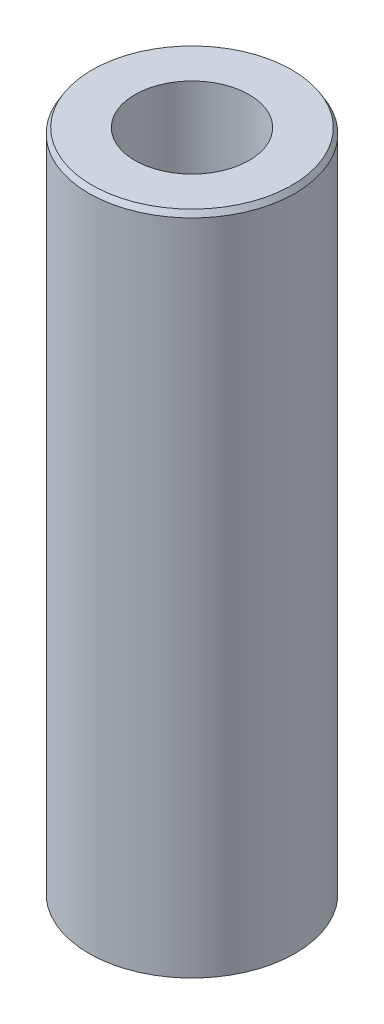
ISO-10303-21;
HEADER;
FILE_DESCRIPTION(('STEP AP214'),'2;1');
FILE_NAME('part.step','',(''),(''),'','','');
FILE_SCHEMA(('AUTOMOTIVE_DESIGN { 1 0 10303 214 1 1 1 1 }'));
ENDSEC;
DATA;
#1=APPLICATION_CONTEXT('core data for automotive mechanical design processes');
#2=APPLICATION_PROTOCOL_DEFINITION('international standard','automotive_design',2000,#1);
#3=PRODUCT_CONTEXT('',#1,'mechanical');
#4=PRODUCT('Part','Part','',(#3));
#5=PRODUCT_RELATED_PRODUCT_CATEGORY('part','',(#4));
#6=PRODUCT_DEFINITION_FORMATION('','',#4);
#7=PRODUCT_DEFINITION_CONTEXT('part definition',#1,'design');
#8=PRODUCT_DEFINITION('design','',#6,#7);
#9=PRODUCT_DEFINITION_SHAPE('','',#8);
#10=(LENGTH_UNIT() NAMED_UNIT(*) SI_UNIT(.MILLI.,.METRE.));
#11=(NAMED_UNIT(*) PLANE_ANGLE_UNIT() SI_UNIT($,.RADIAN.));
#12=(NAMED_UNIT(*) SI_UNIT($,.STERADIAN.) SOLID_ANGLE_UNIT());
#13=UNCERTAINTY_MEASURE_WITH_UNIT(LENGTH_MEASURE(1.E-05),#10,'distance_accuracy_value','');
#14=(GEOMETRIC_REPRESENTATION_CONTEXT(3) GLOBAL_UNCERTAINTY_ASSIGNED_CONTEXT((#13)) GLOBAL_UNIT_ASSIGNED_CONTEXT((#10,
#11,#12)) REPRESENTATION_CONTEXT('',''));
#15=CARTESIAN_POINT('',(0.,0.,0.));
#16=DIRECTION('',(0.,0.,1.));
#17=DIRECTION('',(1.,0.,0.));
#18=AXIS2_PLACEMENT_3D('',#15,#16,#17);
#19=CARTESIAN_POINT('',(0.,387.838968142083,0.));
#20=DIRECTION('',(0.,-1.,0.));
#21=DIRECTION('',(0.,0.,-1.));
#22=AXIS2_PLACEMENT_3D('',#19,#20,#21);
#23=CYLINDRICAL_SURFACE('',#22,60.);
#24=CARTESIAN_POINT('',(0.,384.712801968172,0.));
#25=DIRECTION('',(0.,1.,0.));
#26=DIRECTION('',(0.,0.,1.));
#27=AXIS2_PLACEMENT_3D('',#24,#25,#26);
#28=CIRCLE('',#27,60.);
#29=CARTESIAN_POINT('',(0.,384.712801968171,-60.));
#30=VERTEX_POINT('',#29);
#31=EDGE_CURVE('E50',#30,#30,#28,.F.);
#32=CARTESIAN_POINT('',(0.,1.87388105654263,0.));
#33=DIRECTION('',(0.,1.,0.));
#34=DIRECTION('',(0.,0.,1.));
#35=AXIS2_PLACEMENT_3D('',#32,#33,#34);
#36=CIRCLE('',#35,60.);
#37=CARTESIAN_POINT('',(0.,1.87388105654257,-60.));
#38=VERTEX_POINT('',#37);
#39=EDGE_CURVE('E51',#38,#38,#36,.T.);
#40=CARTESIAN_POINT('',(0.,384.712801968171,-60.));
#41=CARTESIAN_POINT('',(0.,380.724896542009,-60.));
#42=CARTESIAN_POINT('',(0.,376.736991115846,-60.));
#43=CARTESIAN_POINT('',(0.,368.76118026352,-60.));
#44=CARTESIAN_POINT('',(0.,364.773274837357,-60.));
#45=CARTESIAN_POINT('',(0.,356.797463985032,-60.));
#46=CARTESIAN_POINT('',(0.,352.809558558869,-60.));
#47=CARTESIAN_POINT('',(0.,344.833747706543,-60.));
#48=CARTESIAN_POINT('',(0.,340.845842280381,-60.));
#49=CARTESIAN_POINT('',(0.,332.870031428055,-60.));
#50=CARTESIAN_POINT('',(0.,328.882126001892,-60.));
#51=CARTESIAN_POINT('',(0.,320.906315149567,-60.));
#52=CARTESIAN_POINT('',(0.,316.918409723404,-60.));
#53=CARTESIAN_POINT('',(0.,308.942598871078,-60.));
#54=CARTESIAN_POINT('',(0.,304.954693444915,-60.));
#55=CARTESIAN_POINT('',(0.,296.97888259259,-60.));
#56=CARTESIAN_POINT('',(0.,292.990977166427,-60.));
#57=CARTESIAN_POINT('',(0.,285.015166314101,-60.));
#58=CARTESIAN_POINT('',(0.,281.027260887939,-60.));
#59=CARTESIAN_POINT('',(0.,273.051450035613,-60.));
#60=CARTESIAN_POINT('',(0.,269.06354460945,-60.));
#61=CARTESIAN_POINT('',(0.,261.087733757125,-60.));
#62=CARTESIAN_POINT('',(0.,257.099828330962,-60.));
#63=CARTESIAN_POINT('',(0.,249.124017478636,-60.));
#64=CARTESIAN_POINT('',(0.,245.136112052473,-60.));
#65=CARTESIAN_POINT('',(0.,237.160301200148,-60.));
#66=CARTESIAN_POINT('',(0.,233.172395773985,-60.));
#67=CARTESIAN_POINT('',(0.,225.196584921659,-60.));
#68=CARTESIAN_POINT('',(0.,221.208679495497,-60.));
#69=CARTESIAN_POINT('',(0.,213.232868643171,-60.));
#70=CARTESIAN_POINT('',(0.,209.244963217008,-60.));
#71=CARTESIAN_POINT('',(0.,201.269152364683,-60.));
#72=CARTESIAN_POINT('',(0.,197.28124693852,-60.));
#73=CARTESIAN_POINT('',(0.,189.305436086194,-60.));
#74=CARTESIAN_POINT('',(0.,185.317530660031,-60.));
#75=CARTESIAN_POINT('',(0.,177.341719807706,-60.));
#76=CARTESIAN_POINT('',(0.,173.353814381543,-60.));
#77=CARTESIAN_POINT('',(0.,165.378003529217,-60.));
#78=CARTESIAN_POINT('',(0.,161.390098103055,-60.));
#79=CARTESIAN_POINT('',(0.,153.414287250729,-60.));
#80=CARTESIAN_POINT('',(0.,149.426381824566,-60.));
#81=CARTESIAN_POINT('',(0.,141.450570972241,-60.));
#82=CARTESIAN_POINT('',(0.,137.462665546078,-60.));
#83=CARTESIAN_POINT('',(0.,129.486854693752,-60.));
#84=CARTESIAN_POINT('',(0.,125.498949267589,-60.));
#85=CARTESIAN_POINT('',(0.,117.523138415264,-60.));
#86=CARTESIAN_POINT('',(0.,113.535232989101,-60.));
#87=CARTESIAN_POINT('',(0.,105.559422136775,-60.));
#88=CARTESIAN_POINT('',(0.,101.571516710613,-60.));
#89=CARTESIAN_POINT('',(0.,93.595705858287,-60.));
#90=CARTESIAN_POINT('',(0.,89.6078004321242,-60.));
#91=CARTESIAN_POINT('',(0.,81.6319895797986,-60.));
#92=CARTESIAN_POINT('',(0.,77.6440841536358,-60.));
#93=CARTESIAN_POINT('',(0.,69.6682733013102,-60.));
#94=CARTESIAN_POINT('',(0.,65.6803678751474,-60.));
#95=CARTESIAN_POINT('',(0.,57.7045570228218,-60.));
#96=CARTESIAN_POINT('',(0.,53.716651596659,-60.));
#97=CARTESIAN_POINT('',(0.,45.7408407443334,-60.));
#98=CARTESIAN_POINT('',(0.,41.7529353181706,-60.));
#99=CARTESIAN_POINT('',(0.,33.777124465845,-60.));
#100=CARTESIAN_POINT('',(0.,29.7892190396822,-60.));
#101=CARTESIAN_POINT('',(0.,21.8134081873566,-60.));
#102=CARTESIAN_POINT('',(0.,17.8255027611938,-60.));
#103=CARTESIAN_POINT('',(0.,9.84969190886818,-60.));
#104=CARTESIAN_POINT('',(0.,5.86178648270538,-60.));
#105=CARTESIAN_POINT('',(0.,1.87388105654257,-60.));
#106=B_SPLINE_CURVE_WITH_KNOTS('',3,(#40,#41,#42,#43,#44,#45,#46,#47,#48,#49,#50,#51,#52,#53,
#54,#55,#56,#57,#58,#59,#60,#61,#62,#63,#64,#65,#66,#67,#68,#69,#70,#71,#72,#73,#74,#75,#76,#77,
#78,#79,#80,#81,#82,#83,#84,#85,#86,#87,#88,#89,#90,#91,#92,#93,#94,#95,#96,#97,#98,#99,#100,
#101,#102,#103,#104,#105),.UNSPECIFIED.,.F.,.F.,(4,2,2,2,2,2,2,2,2,2,2,2,2,2,2,2,2,2,2,2,2,2,2,
2,2,2,2,2,2,2,2,2,4),(0.,11.9637162784884,23.9274325569768,35.8911488354652,47.8548651139536,
59.8185813924419,71.7822976709304,83.7460139494188,95.7097302279072,107.673446506396,
119.637162784884,131.600879063372,143.564595341861,155.528311620349,167.492027898838,
179.455744177326,191.419460455814,203.383176734303,215.346893012791,227.31060929128,
239.274325569768,251.238041848256,263.201758126745,275.165474405233,287.129190683722,
299.09290696221,311.056623240698,323.020339519187,334.984055797675,346.947772076164,
358.911488354652,370.87520463314,382.838920911629),.UNSPECIFIED.);
#107=EDGE_CURVE('BSEAM39',#30,#38,#106,.T.);
#108=ORIENTED_EDGE('',*,*,#31,.T.);
#109=ORIENTED_EDGE('',*,*,#39,.T.);
#110=ORIENTED_EDGE('',*,*,#107,.T.);
#111=ORIENTED_EDGE('',*,*,#107,.F.);
#112=EDGE_LOOP('',(#108,#110,#109,#111));
#113=FACE_BOUND('',#112,.T.);
#114=ADVANCED_FACE('F39',(#113),#23,.T.);
#115=CARTESIAN_POINT('',(0.,387.838968142083,0.));
#116=DIRECTION('',(0.,1.,0.));
#117=DIRECTION('',(0.,0.,1.));
#118=AXIS2_PLACEMENT_3D('',#115,#116,#117);
#119=PLANE('',#118);
#120=CARTESIAN_POINT('',(0.,387.838968142083,0.));
#121=DIRECTION('',(0.,1.,0.));
#122=DIRECTION('',(0.,0.,1.));
#123=AXIS2_PLACEMENT_3D('',#120,#121,#122);
#124=CIRCLE('',#123,58.1261189434577);
#125=CARTESIAN_POINT('',(0.,387.838968142082,-58.1261189434577));
#126=VERTEX_POINT('',#125);
#127=EDGE_CURVE('E54',#126,#126,#124,.T.);
#128=ORIENTED_EDGE('',*,*,#127,.T.);
#129=EDGE_LOOP('',(#128));
#130=FACE_BOUND('',#129,.T.);
#131=CARTESIAN_POINT('',(0.,387.838968142083,0.));
#132=DIRECTION('',(0.,1.,0.));
#133=DIRECTION('',(0.,0.,1.));
#134=AXIS2_PLACEMENT_3D('',#131,#132,#133);
#135=CIRCLE('',#134,33.1999643951958);
#136=CARTESIAN_POINT('',(0.,387.838968142082,-33.1999643951958));
#137=VERTEX_POINT('',#136);
#138=EDGE_CURVE('E58',#137,#137,#135,.T.);
#139=ORIENTED_EDGE('',*,*,#138,.F.);
#140=EDGE_LOOP('',(#139));
#141=FACE_BOUND('',#140,.T.);
#142=ADVANCED_FACE('F69',(#130,#141),#119,.T.);
#143=CARTESIAN_POINT('',(0.,0.,0.));
#144=DIRECTION('',(0.,1.,0.));
#145=DIRECTION('',(0.,0.,1.));
#146=AXIS2_PLACEMENT_3D('',#143,#144,#145);
#147=PLANE('',#146);
#148=CARTESIAN_POINT('',(0.,0.,0.));
#149=DIRECTION('',(0.,1.,0.));
#150=DIRECTION('',(0.,0.,1.));
#151=AXIS2_PLACEMENT_3D('',#148,#149,#150);
#152=CIRCLE('',#151,56.8738338260883);
#153=CARTESIAN_POINT('',(0.,0.,56.8738338260883));
#154=VERTEX_POINT('',#153);
#155=EDGE_CURVE('E10',#154,#154,#152,.F.);
#156=ORIENTED_EDGE('',*,*,#155,.T.);
#157=EDGE_LOOP('',(#156));
#158=FACE_BOUND('',#157,.T.);
#159=CARTESIAN_POINT('',(0.,0.,0.));
#160=DIRECTION('',(0.,1.,0.));
#161=DIRECTION('',(0.,0.,1.));
#162=AXIS2_PLACEMENT_3D('',#159,#160,#161);
#163=CIRCLE('',#162,33.1999643951958);
#164=CARTESIAN_POINT('',(0.,0.,-33.1999643951958));
#165=VERTEX_POINT('',#164);
#166=EDGE_CURVE('E63',#165,#165,#163,.T.);
#167=ORIENTED_EDGE('',*,*,#166,.T.);
#168=EDGE_LOOP('',(#167));
#169=FACE_BOUND('',#168,.T.);
#170=ADVANCED_FACE('F75',(#158,#169),#147,.F.);
#171=CARTESIAN_POINT('',(0.,387.838968142083,0.));
#172=DIRECTION('',(0.,-1.,0.));
#173=DIRECTION('',(0.,0.,-1.));
#174=AXIS2_PLACEMENT_3D('',#171,#172,#173);
#175=CYLINDRICAL_SURFACE('',#174,33.1999643951958);
#176=CARTESIAN_POINT('',(0.,387.838968142082,-33.1999643951958));
#177=CARTESIAN_POINT('',(0.,383.798978890602,-33.1999643951958));
#178=CARTESIAN_POINT('',(0.,379.758989639122,-33.1999643951958));
#179=CARTESIAN_POINT('',(0.,371.679011136162,-33.1999643951958));
#180=CARTESIAN_POINT('',(0.,367.639021884682,-33.1999643951958));
#181=CARTESIAN_POINT('',(0.,359.559043381722,-33.1999643951958));
#182=CARTESIAN_POINT('',(0.,355.519054130242,-33.1999643951958));
#183=CARTESIAN_POINT('',(0.,347.439075627282,-33.1999643951958));
#184=CARTESIAN_POINT('',(0.,343.399086375802,-33.1999643951958));
#185=CARTESIAN_POINT('',(0.,335.319107872842,-33.1999643951958));
#186=CARTESIAN_POINT('',(0.,331.279118621362,-33.1999643951958));
#187=CARTESIAN_POINT('',(0.,323.199140118402,-33.1999643951958));
#188=CARTESIAN_POINT('',(0.,319.159150866922,-33.1999643951958));
#189=CARTESIAN_POINT('',(0.,311.079172363962,-33.1999643951958));
#190=CARTESIAN_POINT('',(0.,307.039183112482,-33.1999643951958));
#191=CARTESIAN_POINT('',(0.,298.959204609522,-33.1999643951958));
#192=CARTESIAN_POINT('',(0.,294.919215358042,-33.1999643951958));
#193=CARTESIAN_POINT('',(0.,286.839236855082,-33.1999643951958));
#194=CARTESIAN_POINT('',(0.,282.799247603602,-33.1999643951958));
#195=CARTESIAN_POINT('',(0.,274.719269100642,-33.1999643951958));
#196=CARTESIAN_POINT('',(0.,270.679279849162,-33.1999643951958));
#197=CARTESIAN_POINT('',(0.,262.599301346202,-33.1999643951958));
#198=CARTESIAN_POINT('',(0.,258.559312094722,-33.1999643951958));
#199=CARTESIAN_POINT('',(0.,250.479333591762,-33.1999643951958));
#200=CARTESIAN_POINT('',(0.,246.439344340282,-33.1999643951958));
#201=CARTESIAN_POINT('',(0.,238.359365837322,-33.1999643951958));
#202=CARTESIAN_POINT('',(0.,234.319376585841,-33.1999643951958));
#203=CARTESIAN_POINT('',(0.,226.239398082881,-33.1999643951958));
#204=CARTESIAN_POINT('',(0.,222.199408831401,-33.1999643951958));
#205=CARTESIAN_POINT('',(0.,214.119430328441,-33.1999643951958));
#206=CARTESIAN_POINT('',(0.,210.079441076961,-33.1999643951958));
#207=CARTESIAN_POINT('',(0.,201.999462574001,-33.1999643951958));
#208=CARTESIAN_POINT('',(0.,197.959473322521,-33.1999643951958));
#209=CARTESIAN_POINT('',(0.,189.879494819561,-33.1999643951958));
#210=CARTESIAN_POINT('',(0.,185.839505568081,-33.1999643951958));
#211=CARTESIAN_POINT('',(0.,177.759527065121,-33.1999643951958));
#212=CARTESIAN_POINT('',(0.,173.719537813641,-33.1999643951958));
#213=CARTESIAN_POINT('',(0.,165.639559310681,-33.1999643951958));
#214=CARTESIAN_POINT('',(0.,161.599570059201,-33.1999643951958));
#215=CARTESIAN_POINT('',(0.,153.519591556241,-33.1999643951958));
#216=CARTESIAN_POINT('',(0.,149.479602304761,-33.1999643951958));
#217=CARTESIAN_POINT('',(0.,141.399623801801,-33.1999643951958));
#218=CARTESIAN_POINT('',(0.,137.359634550321,-33.1999643951958));
#219=CARTESIAN_POINT('',(0.,129.279656047361,-33.1999643951958));
#220=CARTESIAN_POINT('',(0.,125.239666795881,-33.1999643951958));
#221=CARTESIAN_POINT('',(0.,117.159688292921,-33.1999643951958));
#222=CARTESIAN_POINT('',(0.,113.119699041441,-33.1999643951958));
#223=CARTESIAN_POINT('',(0.,105.039720538481,-33.1999643951958));
#224=CARTESIAN_POINT('',(0.,100.999731287001,-33.1999643951958));
#225=CARTESIAN_POINT('',(0.,92.9197527840406,-33.1999643951958));
#226=CARTESIAN_POINT('',(0.,88.8797635325605,-33.1999643951958));
#227=CARTESIAN_POINT('',(0.,80.7997850296005,-33.1999643951958));
#228=CARTESIAN_POINT('',(0.,76.7597957781205,-33.1999643951958));
#229=CARTESIAN_POINT('',(0.,68.6798172751604,-33.1999643951958));
#230=CARTESIAN_POINT('',(0.,64.6398280236804,-33.1999643951958));
#231=CARTESIAN_POINT('',(0.,56.5598495207203,-33.1999643951958));
#232=CARTESIAN_POINT('',(0.,52.5198602692403,-33.1999643951958));
#233=CARTESIAN_POINT('',(0.,44.4398817662802,-33.1999643951958));
#234=CARTESIAN_POINT('',(0.,40.3998925148002,-33.1999643951958));
#235=CARTESIAN_POINT('',(0.,32.3199140118401,-33.1999643951958));
#236=CARTESIAN_POINT('',(0.,28.2799247603601,-33.1999643951958));
#237=CARTESIAN_POINT('',(0.,20.1999462574001,-33.1999643951958));
#238=CARTESIAN_POINT('',(0.,16.15995700592,-33.1999643951958));
#239=CARTESIAN_POINT('',(0.,8.07997850295999,-33.1999643951958));
#240=CARTESIAN_POINT('',(0.,4.03998925147997,-33.1999643951958));
#241=CARTESIAN_POINT('',(0.,0.,-33.1999643951958));
#242=B_SPLINE_CURVE_WITH_KNOTS('',3,(#176,#177,#178,#179,#180,#181,#182,#183,#184,#185,#186,
#187,#188,#189,#190,#191,#192,#193,#194,#195,#196,#197,#198,#199,#200,#201,#202,#203,#204,#205,
#206,#207,#208,#209,#210,#211,#212,#213,#214,#215,#216,#217,#218,#219,#220,#221,#222,#223,#224,
#225,#226,#227,#228,#229,#230,#231,#232,#233,#234,#235,#236,#237,#238,#239,#240,#241),
.UNSPECIFIED.,.F.,.F.,(4,2,2,2,2,2,2,2,2,2,2,2,2,2,2,2,2,2,2,2,2,2,2,2,2,2,2,2,2,2,2,2,4),(0.,
12.1199677544401,24.2399355088802,36.3599032633202,48.4798710177603,60.5998387722004,
72.7198065266405,84.8397742810805,96.9597420355206,109.079709789961,121.199677544401,
133.319645298841,145.439613053281,157.559580807721,169.679548562161,181.799516316601,
193.919484071041,206.039451825481,218.159419579921,230.279387334361,242.399355088802,
254.519322843242,266.639290597682,278.759258352122,290.879226106562,302.999193861002,
315.119161615442,327.239129369882,339.359097124322,351.479064878762,363.599032633202,
375.719000387642,387.838968142083),.UNSPECIFIED.);
#243=EDGE_CURVE('BSEAM70',#137,#165,#242,.T.);
#244=ORIENTED_EDGE('',*,*,#138,.T.);
#245=ORIENTED_EDGE('',*,*,#166,.F.);
#246=ORIENTED_EDGE('',*,*,#243,.T.);
#247=ORIENTED_EDGE('',*,*,#243,.F.);
#248=EDGE_LOOP('',(#244,#246,#245,#247));
#249=FACE_BOUND('',#248,.T.);
#250=ADVANCED_FACE('F70',(#249),#175,.F.);
#251=CARTESIAN_POINT('',(0.,387.838968142083,0.));
#252=DIRECTION('',(0.,-1.,0.));
#253=DIRECTION('',(0.,0.,-1.));
#254=AXIS2_PLACEMENT_3D('',#251,#252,#253);
#255=CONICAL_SURFACE('',#254,58.1261189434577,0.539991632980872);
#256=CARTESIAN_POINT('',(0.,384.712801968171,-60.));
#257=CARTESIAN_POINT('',(0.,384.74536619915,-59.980480405661));
#258=CARTESIAN_POINT('',(0.,384.777930430128,-59.9609608113221));
#259=CARTESIAN_POINT('',(0.,384.843058892084,-59.9219216226441));
#260=CARTESIAN_POINT('',(0.,384.875623123063,-59.9024020283051));
#261=CARTESIAN_POINT('',(0.,384.940751585019,-59.8633628396271));
#262=CARTESIAN_POINT('',(0.,384.973315815997,-59.8438432452882));
#263=CARTESIAN_POINT('',(0.,385.038444277954,-59.8048040566102));
#264=CARTESIAN_POINT('',(0.,385.071008508932,-59.7852844622712));
#265=CARTESIAN_POINT('',(0.,385.136136970889,-59.7462452735932));
#266=CARTESIAN_POINT('',(0.,385.168701201867,-59.7267256792543));
#267=CARTESIAN_POINT('',(0.,385.233829663823,-59.6876864905763));
#268=CARTESIAN_POINT('',(0.,385.266393894801,-59.6681668962373));
#269=CARTESIAN_POINT('',(0.,385.331522356758,-59.6291277075594));
#270=CARTESIAN_POINT('',(0.,385.364086587736,-59.6096081132204));
#271=CARTESIAN_POINT('',(0.,385.429215049693,-59.5705689245424));
#272=CARTESIAN_POINT('',(0.,385.461779280671,-59.5510493302034));
#273=CARTESIAN_POINT('',(0.,385.526907742627,-59.5120101415255));
#274=CARTESIAN_POINT('',(0.,385.559471973606,-59.4924905471865));
#275=CARTESIAN_POINT('',(0.,385.624600435562,-59.4534513585085));
#276=CARTESIAN_POINT('',(0.,385.65716466654,-59.4339317641695));
#277=CARTESIAN_POINT('',(0.,385.722293128497,-59.3948925754916));
#278=CARTESIAN_POINT('',(0.,385.754857359475,-59.3753729811526));
#279=CARTESIAN_POINT('',(0.,385.819985821432,-59.3363337924746));
#280=CARTESIAN_POINT('',(0.,385.85255005241,-59.3168141981356));
#281=CARTESIAN_POINT('',(0.,385.917678514366,-59.2777750094577));
#282=CARTESIAN_POINT('',(0.,385.950242745345,-59.2582554151187));
#283=CARTESIAN_POINT('',(0.,386.015371207301,-59.2192162264407));
#284=CARTESIAN_POINT('',(0.,386.047935438279,-59.1996966321017));
#285=CARTESIAN_POINT('',(0.,386.113063900236,-59.1606574434238));
#286=CARTESIAN_POINT('',(0.,386.145628131214,-59.1411378490848));
#287=CARTESIAN_POINT('',(0.,386.210756593171,-59.1020986604068));
#288=CARTESIAN_POINT('',(0.,386.243320824149,-59.0825790660679));
#289=CARTESIAN_POINT('',(0.,386.308449286105,-59.0435398773899));
#290=CARTESIAN_POINT('',(0.,386.341013517083,-59.0240202830509));
#291=CARTESIAN_POINT('',(0.,386.40614197904,-58.984981094373));
#292=CARTESIAN_POINT('',(0.,386.438706210018,-58.965461500034));
#293=CARTESIAN_POINT('',(0.,386.503834671975,-58.926422311356));
#294=CARTESIAN_POINT('',(0.,386.536398902953,-58.906902717017));
#295=CARTESIAN_POINT('',(0.,386.601527364909,-58.8678635283391));
#296=CARTESIAN_POINT('',(0.,386.634091595888,-58.8483439340001));
#297=CARTESIAN_POINT('',(0.,386.699220057844,-58.8093047453221));
#298=CARTESIAN_POINT('',(0.,386.731784288822,-58.7897851509831));
#299=CARTESIAN_POINT('',(0.,386.796912750779,-58.7507459623052));
#300=CARTESIAN_POINT('',(0.,386.829476981757,-58.7312263679662));
#301=CARTESIAN_POINT('',(0.,386.894605443713,-58.6921871792882));
#302=CARTESIAN_POINT('',(0.,386.927169674692,-58.6726675849492));
#303=CARTESIAN_POINT('',(0.,386.992298136648,-58.6336283962713));
#304=CARTESIAN_POINT('',(0.,387.024862367626,-58.6141088019323));
#305=CARTESIAN_POINT('',(0.,387.089990829583,-58.5750696132543));
#306=CARTESIAN_POINT('',(0.,387.122555060561,-58.5555500189153));
#307=CARTESIAN_POINT('',(0.,387.187683522518,-58.5165108302374));
#308=CARTESIAN_POINT('',(0.,387.220247753496,-58.4969912358984));
#309=CARTESIAN_POINT('',(0.,387.285376215452,-58.4579520472204));
#310=CARTESIAN_POINT('',(0.,387.317940446431,-58.4384324528814));
#311=CARTESIAN_POINT('',(0.,387.383068908387,-58.3993932642035));
#312=CARTESIAN_POINT('',(0.,387.415633139365,-58.3798736698645));
#313=CARTESIAN_POINT('',(0.,387.480761601322,-58.3408344811865));
#314=CARTESIAN_POINT('',(0.,387.5133258323,-58.3213148868476));
#315=CARTESIAN_POINT('',(0.,387.578454294257,-58.2822756981696));
#316=CARTESIAN_POINT('',(0.,387.611018525235,-58.2627561038306));
#317=CARTESIAN_POINT('',(0.,387.676146987191,-58.2237169151527));
#318=CARTESIAN_POINT('',(0.,387.70871121817,-58.2041973208137));
#319=CARTESIAN_POINT('',(0.,387.773839680126,-58.1651581321357));
#320=CARTESIAN_POINT('',(0.,387.806403911104,-58.1456385377967));
#321=CARTESIAN_POINT('',(0.,387.838968142083,-58.1261189434577));
#322=B_SPLINE_CURVE_WITH_KNOTS('',3,(#256,#257,#258,#259,#260,#261,#262,#263,#264,#265,#266,
#267,#268,#269,#270,#271,#272,#273,#274,#275,#276,#277,#278,#279,#280,#281,#282,#283,#284,#285,
#286,#287,#288,#289,#290,#291,#292,#293,#294,#295,#296,#297,#298,#299,#300,#301,#302,#303,#304,
#305,#306,#307,#308,#309,#310,#311,#312,#313,#314,#315,#316,#317,#318,#319,#320,#321),
.UNSPECIFIED.,.F.,.F.,(4,2,2,2,2,2,2,2,2,2,2,2,2,2,2,2,2,2,2,2,2,2,2,2,2,2,2,2,2,2,2,2,4),(0.,
0.113899048816346,0.227798097632644,0.341697146448993,0.455596195265292,0.569495244081641,
0.683394292897939,0.797293341714289,0.911192390530587,1.02509143934693,1.13899048816323,
1.25288953697958,1.36678858579593,1.48068763461223,1.59458668342853,1.70848573224488,
1.82238478106118,1.93628382987752,2.05018287869382,2.16408192751017,2.27798097632647,
2.39188002514282,2.50577907395912,2.61967812277547,2.73357717159181,2.84747622040811,
2.96137526922446,3.07527431804076,3.18917336685711,3.30307241567341,3.41697146448976,
3.53087051330606,3.6447695621224),.UNSPECIFIED.);
#323=EDGE_CURVE('BSEAM81',#30,#126,#322,.T.);
#324=ORIENTED_EDGE('',*,*,#31,.F.);
#325=ORIENTED_EDGE('',*,*,#127,.F.);
#326=ORIENTED_EDGE('',*,*,#323,.T.);
#327=ORIENTED_EDGE('',*,*,#323,.F.);
#328=EDGE_LOOP('',(#324,#326,#325,#327));
#329=FACE_BOUND('',#328,.T.);
#330=ADVANCED_FACE('F81',(#329),#255,.T.);
#331=CARTESIAN_POINT('',(0.,1.87388105654263,0.));
#332=DIRECTION('',(0.,1.,0.));
#333=DIRECTION('',(0.,0.,1.));
#334=AXIS2_PLACEMENT_3D('',#331,#332,#333);
#335=CONICAL_SURFACE('',#334,60.,1.03080469381403);
#336=ORIENTED_EDGE('',*,*,#155,.F.);
#337=EDGE_LOOP('',(#336));
#338=FACE_BOUND('',#337,.T.);
#339=ORIENTED_EDGE('',*,*,#39,.F.);
#340=EDGE_LOOP('',(#339));
#341=FACE_BOUND('',#340,.T.);
#342=ADVANCED_FACE('F45',(#338,#341),#335,.T.);
#343=CLOSED_SHELL('',(#114,#142,#170,#250,#330,#342));
#344=MANIFOLD_SOLID_BREP('B2',#343);
#345=ADVANCED_BREP_SHAPE_REPRESENTATION('',(#18,#344),#14);
#346=SHAPE_DEFINITION_REPRESENTATION(#9,#345);
ENDSEC;
END-ISO-10303-21;
